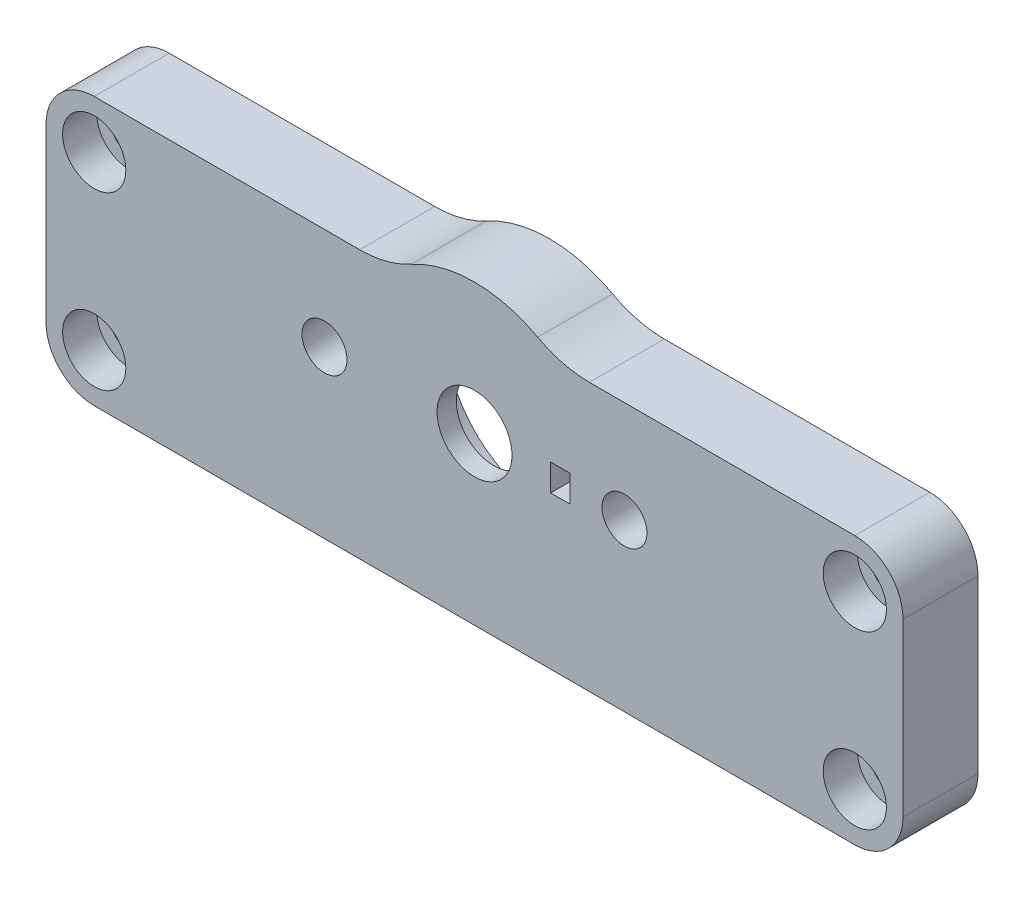
ISO-10303-21;
HEADER;
FILE_DESCRIPTION(('STEP AP214'),'2;1');
FILE_NAME('part.step','',(''),(''),'','','');
FILE_SCHEMA(('AUTOMOTIVE_DESIGN { 1 0 10303 214 1 1 1 1 }'));
ENDSEC;
DATA;
#1=APPLICATION_CONTEXT('core data for automotive mechanical design processes');
#2=APPLICATION_PROTOCOL_DEFINITION('international standard','automotive_design',2000,#1);
#3=PRODUCT_CONTEXT('',#1,'mechanical');
#4=PRODUCT('Part','Part','',(#3));
#5=PRODUCT_RELATED_PRODUCT_CATEGORY('part','',(#4));
#6=PRODUCT_DEFINITION_FORMATION('','',#4);
#7=PRODUCT_DEFINITION_CONTEXT('part definition',#1,'design');
#8=PRODUCT_DEFINITION('design','',#6,#7);
#9=PRODUCT_DEFINITION_SHAPE('','',#8);
#10=(LENGTH_UNIT() NAMED_UNIT(*) SI_UNIT(.MILLI.,.METRE.));
#11=(NAMED_UNIT(*) PLANE_ANGLE_UNIT() SI_UNIT($,.RADIAN.));
#12=(NAMED_UNIT(*) SI_UNIT($,.STERADIAN.) SOLID_ANGLE_UNIT());
#13=UNCERTAINTY_MEASURE_WITH_UNIT(LENGTH_MEASURE(1.E-05),#10,'distance_accuracy_value','');
#14=(GEOMETRIC_REPRESENTATION_CONTEXT(3) GLOBAL_UNCERTAINTY_ASSIGNED_CONTEXT((#13)) GLOBAL_UNIT_ASSIGNED_CONTEXT((#10,
#11,#12)) REPRESENTATION_CONTEXT('',''));
#15=CARTESIAN_POINT('',(0.,0.,0.));
#16=DIRECTION('',(0.,0.,1.));
#17=DIRECTION('',(1.,0.,0.));
#18=AXIS2_PLACEMENT_3D('',#15,#16,#17);
#19=CARTESIAN_POINT('',(-35.5,-11.,7.));
#20=DIRECTION('',(0.,0.,-1.));
#21=DIRECTION('',(-1.,0.,0.));
#22=AXIS2_PLACEMENT_3D('',#19,#20,#21);
#23=CYLINDRICAL_SURFACE('',#22,1.65);
#24=CARTESIAN_POINT('',(-35.5,-11.,0.));
#25=DIRECTION('',(0.,0.,1.));
#26=DIRECTION('',(1.,0.,0.));
#27=AXIS2_PLACEMENT_3D('',#24,#25,#26);
#28=CIRCLE('',#27,1.65);
#29=CARTESIAN_POINT('',(-33.85,-11.,0.));
#30=VERTEX_POINT('',#29);
#31=EDGE_CURVE('E229',#30,#30,#28,.T.);
#32=ORIENTED_EDGE('',*,*,#31,.F.);
#33=EDGE_LOOP('',(#32));
#34=FACE_BOUND('',#33,.T.);
#35=CARTESIAN_POINT('',(-35.5,-11.,3.8));
#36=DIRECTION('',(0.,0.,1.));
#37=DIRECTION('',(1.,0.,0.));
#38=AXIS2_PLACEMENT_3D('',#35,#36,#37);
#39=CIRCLE('',#38,1.65);
#40=CARTESIAN_POINT('',(-33.85,-11.,3.8));
#41=VERTEX_POINT('',#40);
#42=EDGE_CURVE('E45',#41,#41,#39,.T.);
#43=ORIENTED_EDGE('',*,*,#42,.T.);
#44=EDGE_LOOP('',(#43));
#45=FACE_BOUND('',#44,.T.);
#46=ADVANCED_FACE('F41',(#34,#45),#23,.F.);
#47=CARTESIAN_POINT('',(-35.5,5.,7.));
#48=DIRECTION('',(0.,0.,-1.));
#49=DIRECTION('',(-1.,0.,0.));
#50=AXIS2_PLACEMENT_3D('',#47,#48,#49);
#51=CYLINDRICAL_SURFACE('',#50,1.65);
#52=CARTESIAN_POINT('',(-35.5,5.,0.));
#53=DIRECTION('',(0.,0.,1.));
#54=DIRECTION('',(1.,0.,0.));
#55=AXIS2_PLACEMENT_3D('',#52,#53,#54);
#56=CIRCLE('',#55,1.65);
#57=CARTESIAN_POINT('',(-33.85,5.,0.));
#58=VERTEX_POINT('',#57);
#59=EDGE_CURVE('E226',#58,#58,#56,.T.);
#60=ORIENTED_EDGE('',*,*,#59,.F.);
#61=EDGE_LOOP('',(#60));
#62=FACE_BOUND('',#61,.T.);
#63=CARTESIAN_POINT('',(-35.5,5.,3.8));
#64=DIRECTION('',(0.,0.,1.));
#65=DIRECTION('',(1.,0.,0.));
#66=AXIS2_PLACEMENT_3D('',#63,#64,#65);
#67=CIRCLE('',#66,1.65);
#68=CARTESIAN_POINT('',(-33.85,5.,3.8));
#69=VERTEX_POINT('',#68);
#70=EDGE_CURVE('E335',#69,#69,#67,.T.);
#71=ORIENTED_EDGE('',*,*,#70,.T.);
#72=EDGE_LOOP('',(#71));
#73=FACE_BOUND('',#72,.T.);
#74=ADVANCED_FACE('F411',(#62,#73),#51,.F.);
#75=CARTESIAN_POINT('',(35.5,-11.,7.));
#76=DIRECTION('',(0.,0.,-1.));
#77=DIRECTION('',(-1.,0.,0.));
#78=AXIS2_PLACEMENT_3D('',#75,#76,#77);
#79=CYLINDRICAL_SURFACE('',#78,1.65);
#80=CARTESIAN_POINT('',(35.5,-11.,0.));
#81=DIRECTION('',(0.,0.,1.));
#82=DIRECTION('',(-1.,0.,0.));
#83=AXIS2_PLACEMENT_3D('',#80,#81,#82);
#84=CIRCLE('',#83,1.65);
#85=CARTESIAN_POINT('',(33.85,-11.,0.));
#86=VERTEX_POINT('',#85);
#87=EDGE_CURVE('E223',#86,#86,#84,.T.);
#88=ORIENTED_EDGE('',*,*,#87,.F.);
#89=EDGE_LOOP('',(#88));
#90=FACE_BOUND('',#89,.T.);
#91=CARTESIAN_POINT('',(35.5,-11.,3.8));
#92=DIRECTION('',(0.,0.,1.));
#93=DIRECTION('',(1.,0.,0.));
#94=AXIS2_PLACEMENT_3D('',#91,#92,#93);
#95=CIRCLE('',#94,1.65);
#96=CARTESIAN_POINT('',(37.15,-11.,3.8));
#97=VERTEX_POINT('',#96);
#98=EDGE_CURVE('E332',#97,#97,#95,.T.);
#99=ORIENTED_EDGE('',*,*,#98,.T.);
#100=EDGE_LOOP('',(#99));
#101=FACE_BOUND('',#100,.T.);
#102=ADVANCED_FACE('F418',(#90,#101),#79,.F.);
#103=CARTESIAN_POINT('',(35.5,5.,7.));
#104=DIRECTION('',(0.,0.,-1.));
#105=DIRECTION('',(-1.,0.,0.));
#106=AXIS2_PLACEMENT_3D('',#103,#104,#105);
#107=CYLINDRICAL_SURFACE('',#106,1.65);
#108=CARTESIAN_POINT('',(35.5,5.,0.));
#109=DIRECTION('',(0.,0.,1.));
#110=DIRECTION('',(-1.,0.,0.));
#111=AXIS2_PLACEMENT_3D('',#108,#109,#110);
#112=CIRCLE('',#111,1.65);
#113=CARTESIAN_POINT('',(33.85,5.,0.));
#114=VERTEX_POINT('',#113);
#115=EDGE_CURVE('E220',#114,#114,#112,.T.);
#116=ORIENTED_EDGE('',*,*,#115,.F.);
#117=EDGE_LOOP('',(#116));
#118=FACE_BOUND('',#117,.T.);
#119=CARTESIAN_POINT('',(35.5,5.,3.8));
#120=DIRECTION('',(0.,0.,1.));
#121=DIRECTION('',(1.,0.,0.));
#122=AXIS2_PLACEMENT_3D('',#119,#120,#121);
#123=CIRCLE('',#122,1.65);
#124=CARTESIAN_POINT('',(37.15,5.,3.8));
#125=VERTEX_POINT('',#124);
#126=EDGE_CURVE('E329',#125,#125,#123,.T.);
#127=ORIENTED_EDGE('',*,*,#126,.T.);
#128=EDGE_LOOP('',(#127));
#129=FACE_BOUND('',#128,.T.);
#130=ADVANCED_FACE('F521',(#118,#129),#107,.F.);
#131=CARTESIAN_POINT('',(0.,0.,5.));
#132=DIRECTION('',(0.,0.,1.));
#133=DIRECTION('',(1.,0.,0.));
#134=AXIS2_PLACEMENT_3D('',#131,#132,#133);
#135=CYLINDRICAL_SURFACE('',#134,7.5);
#136=CARTESIAN_POINT('',(0.,0.,5.2));
#137=DIRECTION('',(0.,0.,1.));
#138=DIRECTION('',(1.,0.,0.));
#139=AXIS2_PLACEMENT_3D('',#136,#137,#138);
#140=CIRCLE('',#139,7.5);
#141=CARTESIAN_POINT('',(7.39509972887452,-1.25,5.2));
#142=VERTEX_POINT('',#141);
#143=CARTESIAN_POINT('',(7.39509972887452,1.25,5.2));
#144=VERTEX_POINT('',#143);
#145=EDGE_CURVE('E321',#142,#144,#140,.F.);
#146=ORIENTED_EDGE('',*,*,#145,.F.);
#147=DIRECTION('',(0.,0.,1.));
#148=VECTOR('',#147,1.);
#149=CARTESIAN_POINT('',(7.39509972887452,-1.25,5.));
#150=LINE('',#149,#148);
#151=CARTESIAN_POINT('',(7.39509972887452,-1.25,5.));
#152=VERTEX_POINT('',#151);
#153=EDGE_CURVE('E202',#142,#152,#150,.F.);
#154=ORIENTED_EDGE('',*,*,#153,.T.);
#155=CARTESIAN_POINT('',(0.,0.,5.));
#156=DIRECTION('',(0.,0.,1.));
#157=DIRECTION('',(1.,0.,0.));
#158=AXIS2_PLACEMENT_3D('',#155,#156,#157);
#159=CIRCLE('',#158,7.5);
#160=CARTESIAN_POINT('',(7.39509972887452,1.25,5.));
#161=VERTEX_POINT('',#160);
#162=EDGE_CURVE('E212',#161,#152,#159,.T.);
#163=ORIENTED_EDGE('',*,*,#162,.F.);
#164=DIRECTION('',(0.,0.,1.));
#165=VECTOR('',#164,1.);
#166=CARTESIAN_POINT('',(7.39509972887452,1.25,5.));
#167=LINE('',#166,#165);
#168=EDGE_CURVE('E194',#161,#144,#167,.T.);
#169=ORIENTED_EDGE('',*,*,#168,.T.);
#170=EDGE_LOOP('',(#146,#154,#163,#169));
#171=FACE_BOUND('',#170,.T.);
#172=ADVANCED_FACE('F425',(#171),#135,.F.);
#173=CARTESIAN_POINT('',(0.,0.,7.));
#174=DIRECTION('',(0.,0.,-1.));
#175=DIRECTION('',(-1.,0.,0.));
#176=AXIS2_PLACEMENT_3D('',#173,#174,#175);
#177=CYLINDRICAL_SURFACE('',#176,9.75);
#178=CARTESIAN_POINT('',(0.,0.,0.));
#179=DIRECTION('',(0.,0.,1.));
#180=DIRECTION('',(1.,0.,0.));
#181=AXIS2_PLACEMENT_3D('',#178,#179,#180);
#182=CIRCLE('',#181,9.75);
#183=CARTESIAN_POINT('',(9.75,0.,0.));
#184=VERTEX_POINT('',#183);
#185=EDGE_CURVE('E232',#184,#184,#182,.T.);
#186=ORIENTED_EDGE('',*,*,#185,.F.);
#187=EDGE_LOOP('',(#186));
#188=FACE_BOUND('',#187,.T.);
#189=CARTESIAN_POINT('',(0.,0.,5.));
#190=DIRECTION('',(0.,0.,1.));
#191=DIRECTION('',(1.,0.,0.));
#192=AXIS2_PLACEMENT_3D('',#189,#190,#191);
#193=CIRCLE('',#192,9.75);
#194=CARTESIAN_POINT('',(9.75,0.,5.));
#195=VERTEX_POINT('',#194);
#196=EDGE_CURVE('E217',#195,#195,#193,.T.);
#197=ORIENTED_EDGE('',*,*,#196,.T.);
#198=EDGE_LOOP('',(#197));
#199=FACE_BOUND('',#198,.T.);
#200=ADVANCED_FACE('F388',(#188,#199),#177,.F.);
#201=CARTESIAN_POINT('',(0.,0.,7.));
#202=DIRECTION('',(0.,0.,-1.));
#203=DIRECTION('',(-1.,0.,0.));
#204=AXIS2_PLACEMENT_3D('',#201,#202,#203);
#205=PLANE('',#204);
#206=CARTESIAN_POINT('',(35.5,5.,7.));
#207=DIRECTION('',(0.,0.,1.));
#208=DIRECTION('',(1.,0.,0.));
#209=AXIS2_PLACEMENT_3D('',#206,#207,#208);
#210=CIRCLE('',#209,2.95);
#211=CARTESIAN_POINT('',(38.45,5.,7.));
#212=VERTEX_POINT('',#211);
#213=EDGE_CURVE('E368',#212,#212,#210,.T.);
#214=ORIENTED_EDGE('',*,*,#213,.F.);
#215=EDGE_LOOP('',(#214));
#216=FACE_BOUND('',#215,.T.);
#217=CARTESIAN_POINT('',(35.5,-11.,7.));
#218=DIRECTION('',(0.,0.,1.));
#219=DIRECTION('',(1.,0.,0.));
#220=AXIS2_PLACEMENT_3D('',#217,#218,#219);
#221=CIRCLE('',#220,2.95);
#222=CARTESIAN_POINT('',(38.45,-11.,7.));
#223=VERTEX_POINT('',#222);
#224=EDGE_CURVE('E374',#223,#223,#221,.T.);
#225=ORIENTED_EDGE('',*,*,#224,.F.);
#226=EDGE_LOOP('',(#225));
#227=FACE_BOUND('',#226,.T.);
#228=CARTESIAN_POINT('',(-35.5,-11.,7.));
#229=DIRECTION('',(0.,0.,1.));
#230=DIRECTION('',(1.,0.,0.));
#231=AXIS2_PLACEMENT_3D('',#228,#229,#230);
#232=CIRCLE('',#231,2.95);
#233=CARTESIAN_POINT('',(-32.55,-11.,7.));
#234=VERTEX_POINT('',#233);
#235=EDGE_CURVE('E362',#234,#234,#232,.T.);
#236=ORIENTED_EDGE('',*,*,#235,.F.);
#237=EDGE_LOOP('',(#236));
#238=FACE_BOUND('',#237,.T.);
#239=CARTESIAN_POINT('',(-35.5,5.,7.));
#240=DIRECTION('',(0.,0.,1.));
#241=DIRECTION('',(1.,0.,0.));
#242=AXIS2_PLACEMENT_3D('',#239,#240,#241);
#243=CIRCLE('',#242,2.95);
#244=CARTESIAN_POINT('',(-32.55,5.,7.));
#245=VERTEX_POINT('',#244);
#246=EDGE_CURVE('E359',#245,#245,#243,.T.);
#247=ORIENTED_EDGE('',*,*,#246,.F.);
#248=EDGE_LOOP('',(#247));
#249=FACE_BOUND('',#248,.T.);
#250=CARTESIAN_POINT('',(-14.,0.,7.));
#251=DIRECTION('',(0.,0.,1.));
#252=DIRECTION('',(1.,0.,0.));
#253=AXIS2_PLACEMENT_3D('',#250,#251,#252);
#254=CIRCLE('',#253,2.1);
#255=CARTESIAN_POINT('',(-11.9,0.,7.));
#256=VERTEX_POINT('',#255);
#257=EDGE_CURVE('E349',#256,#256,#254,.T.);
#258=ORIENTED_EDGE('',*,*,#257,.F.);
#259=EDGE_LOOP('',(#258));
#260=FACE_BOUND('',#259,.T.);
#261=CARTESIAN_POINT('',(14.,0.,7.));
#262=DIRECTION('',(0.,0.,1.));
#263=DIRECTION('',(-1.,0.,0.));
#264=AXIS2_PLACEMENT_3D('',#261,#262,#263);
#265=CIRCLE('',#264,2.1);
#266=CARTESIAN_POINT('',(11.9,0.,7.));
#267=VERTEX_POINT('',#266);
#268=EDGE_CURVE('E344',#267,#267,#265,.T.);
#269=ORIENTED_EDGE('',*,*,#268,.F.);
#270=EDGE_LOOP('',(#269));
#271=FACE_BOUND('',#270,.T.);
#272=DIRECTION('',(-1.,0.,0.));
#273=VECTOR('',#272,1.);
#274=CARTESIAN_POINT('',(7.1,1.25,7.));
#275=LINE('',#274,#273);
#276=CARTESIAN_POINT('',(8.9,1.25,7.));
#277=VERTEX_POINT('',#276);
#278=CARTESIAN_POINT('',(7.1,1.25,7.));
#279=VERTEX_POINT('',#278);
#280=EDGE_CURVE('E180',#277,#279,#275,.T.);
#281=ORIENTED_EDGE('',*,*,#280,.F.);
#282=DIRECTION('',(0.,1.,0.));
#283=VECTOR('',#282,1.);
#284=CARTESIAN_POINT('',(8.9,-1.25,7.));
#285=LINE('',#284,#283);
#286=CARTESIAN_POINT('',(8.9,-1.25,7.));
#287=VERTEX_POINT('',#286);
#288=EDGE_CURVE('E58',#287,#277,#285,.T.);
#289=ORIENTED_EDGE('',*,*,#288,.F.);
#290=DIRECTION('',(1.,0.,0.));
#291=VECTOR('',#290,1.);
#292=CARTESIAN_POINT('',(7.1,-1.25,7.));
#293=LINE('',#292,#291);
#294=CARTESIAN_POINT('',(7.1,-1.25,7.));
#295=VERTEX_POINT('',#294);
#296=EDGE_CURVE('E187',#295,#287,#293,.T.);
#297=ORIENTED_EDGE('',*,*,#296,.F.);
#298=DIRECTION('',(0.,-1.,0.));
#299=VECTOR('',#298,1.);
#300=CARTESIAN_POINT('',(7.1,-1.25,7.));
#301=LINE('',#300,#299);
#302=EDGE_CURVE('E171',#279,#295,#301,.T.);
#303=ORIENTED_EDGE('',*,*,#302,.F.);
#304=EDGE_LOOP('',(#281,#289,#297,#303));
#305=FACE_BOUND('',#304,.T.);
#306=DIRECTION('',(-1.,0.,0.));
#307=VECTOR('',#306,1.);
#308=CARTESIAN_POINT('',(35.5,9.49999999999999,7.));
#309=LINE('',#308,#307);
#310=CARTESIAN_POINT('',(35.5,9.5,7.));
#311=VERTEX_POINT('',#310);
#312=CARTESIAN_POINT('',(10.7150594958684,9.49999999999999,7.));
#313=VERTEX_POINT('',#312);
#314=EDGE_CURVE('E256',#311,#313,#309,.T.);
#315=ORIENTED_EDGE('',*,*,#314,.T.);
#316=CARTESIAN_POINT('',(10.7150594958684,19.5,7.));
#317=DIRECTION('',(0.,0.,-1.));
#318=DIRECTION('',(-1.,0.,0.));
#319=AXIS2_PLACEMENT_3D('',#316,#317,#318);
#320=CIRCLE('',#319,10.);
#321=CARTESIAN_POINT('',(5.89930241907363,10.7359550561798,7.));
#322=VERTEX_POINT('',#321);
#323=EDGE_CURVE('E315',#313,#322,#320,.T.);
#324=ORIENTED_EDGE('',*,*,#323,.T.);
#325=CARTESIAN_POINT('',(0.,0.,7.));
#326=DIRECTION('',(0.,0.,1.));
#327=DIRECTION('',(-1.,0.,0.));
#328=AXIS2_PLACEMENT_3D('',#325,#326,#327);
#329=CIRCLE('',#328,12.25);
#330=CARTESIAN_POINT('',(-5.89930241907363,10.7359550561798,7.));
#331=VERTEX_POINT('',#330);
#332=EDGE_CURVE('E236',#322,#331,#329,.T.);
#333=ORIENTED_EDGE('',*,*,#332,.T.);
#334=CARTESIAN_POINT('',(-10.7150594958684,19.5,7.));
#335=DIRECTION('',(0.,0.,-1.));
#336=DIRECTION('',(-1.,0.,0.));
#337=AXIS2_PLACEMENT_3D('',#334,#335,#336);
#338=CIRCLE('',#337,10.);
#339=CARTESIAN_POINT('',(-10.7150594958684,9.49999999999999,7.));
#340=VERTEX_POINT('',#339);
#341=EDGE_CURVE('E319',#331,#340,#338,.T.);
#342=ORIENTED_EDGE('',*,*,#341,.T.);
#343=DIRECTION('',(-1.,0.,0.));
#344=VECTOR('',#343,1.);
#345=CARTESIAN_POINT('',(-35.5,9.49999999999999,7.));
#346=LINE('',#345,#344);
#347=CARTESIAN_POINT('',(-35.5,9.49999999999999,7.));
#348=VERTEX_POINT('',#347);
#349=EDGE_CURVE('E239',#340,#348,#346,.T.);
#350=ORIENTED_EDGE('',*,*,#349,.T.);
#351=CARTESIAN_POINT('',(-35.5,5.,7.));
#352=DIRECTION('',(0.,0.,1.));
#353=DIRECTION('',(-1.,0.,0.));
#354=AXIS2_PLACEMENT_3D('',#351,#352,#353);
#355=CIRCLE('',#354,4.5);
#356=CARTESIAN_POINT('',(-40.,5.,7.));
#357=VERTEX_POINT('',#356);
#358=EDGE_CURVE('E242',#348,#357,#355,.T.);
#359=ORIENTED_EDGE('',*,*,#358,.T.);
#360=DIRECTION('',(0.,-1.,0.));
#361=VECTOR('',#360,1.);
#362=CARTESIAN_POINT('',(-40.,-11.,7.));
#363=LINE('',#362,#361);
#364=CARTESIAN_POINT('',(-40.,-11.,7.));
#365=VERTEX_POINT('',#364);
#366=EDGE_CURVE('E244',#357,#365,#363,.T.);
#367=ORIENTED_EDGE('',*,*,#366,.T.);
#368=CARTESIAN_POINT('',(-35.5,-11.,7.));
#369=DIRECTION('',(0.,0.,1.));
#370=DIRECTION('',(-1.,0.,0.));
#371=AXIS2_PLACEMENT_3D('',#368,#369,#370);
#372=CIRCLE('',#371,4.5);
#373=CARTESIAN_POINT('',(-35.5,-15.5,7.));
#374=VERTEX_POINT('',#373);
#375=EDGE_CURVE('E246',#365,#374,#372,.T.);
#376=ORIENTED_EDGE('',*,*,#375,.T.);
#377=DIRECTION('',(1.,0.,0.));
#378=VECTOR('',#377,1.);
#379=CARTESIAN_POINT('',(35.5,-15.5,7.));
#380=LINE('',#379,#378);
#381=CARTESIAN_POINT('',(35.5,-15.5,7.));
#382=VERTEX_POINT('',#381);
#383=EDGE_CURVE('E248',#374,#382,#380,.T.);
#384=ORIENTED_EDGE('',*,*,#383,.T.);
#385=CARTESIAN_POINT('',(35.5,-11.,7.));
#386=DIRECTION('',(0.,0.,1.));
#387=DIRECTION('',(1.,0.,0.));
#388=AXIS2_PLACEMENT_3D('',#385,#386,#387);
#389=CIRCLE('',#388,4.5);
#390=CARTESIAN_POINT('',(40.,-11.,7.));
#391=VERTEX_POINT('',#390);
#392=EDGE_CURVE('E250',#382,#391,#389,.T.);
#393=ORIENTED_EDGE('',*,*,#392,.T.);
#394=DIRECTION('',(0.,1.,0.));
#395=VECTOR('',#394,1.);
#396=CARTESIAN_POINT('',(40.,-11.,7.));
#397=LINE('',#396,#395);
#398=CARTESIAN_POINT('',(40.,5.,7.));
#399=VERTEX_POINT('',#398);
#400=EDGE_CURVE('E252',#391,#399,#397,.T.);
#401=ORIENTED_EDGE('',*,*,#400,.T.);
#402=CARTESIAN_POINT('',(35.5,5.,7.));
#403=DIRECTION('',(0.,0.,1.));
#404=DIRECTION('',(1.,0.,0.));
#405=AXIS2_PLACEMENT_3D('',#402,#403,#404);
#406=CIRCLE('',#405,4.5);
#407=EDGE_CURVE('E254',#399,#311,#406,.T.);
#408=ORIENTED_EDGE('',*,*,#407,.T.);
#409=EDGE_LOOP('',(#315,#324,#333,#342,#350,#359,#367,#376,#384,#393,#401,#408));
#410=FACE_BOUND('',#409,.T.);
#411=CARTESIAN_POINT('',(0.,0.,7.));
#412=DIRECTION('',(0.,0.,1.));
#413=DIRECTION('',(1.,0.,0.));
#414=AXIS2_PLACEMENT_3D('',#411,#412,#413);
#415=CIRCLE('',#414,3.5);
#416=CARTESIAN_POINT('',(3.5,0.,7.));
#417=VERTEX_POINT('',#416);
#418=EDGE_CURVE('E208',#417,#417,#415,.T.);
#419=ORIENTED_EDGE('',*,*,#418,.F.);
#420=EDGE_LOOP('',(#419));
#421=FACE_BOUND('',#420,.T.);
#422=ADVANCED_FACE('F184',(#216,#227,#238,#249,#260,#271,#305,#410,#421),#205,.F.);
#423=CARTESIAN_POINT('',(0.,0.,0.));
#424=DIRECTION('',(0.,0.,-1.));
#425=DIRECTION('',(-1.,0.,0.));
#426=AXIS2_PLACEMENT_3D('',#423,#424,#425);
#427=PLANE('',#426);
#428=ORIENTED_EDGE('',*,*,#87,.T.);
#429=EDGE_LOOP('',(#428));
#430=FACE_BOUND('',#429,.T.);
#431=ORIENTED_EDGE('',*,*,#31,.T.);
#432=EDGE_LOOP('',(#431));
#433=FACE_BOUND('',#432,.T.);
#434=CARTESIAN_POINT('',(0.,0.,0.));
#435=DIRECTION('',(0.,0.,1.));
#436=DIRECTION('',(-1.,0.,0.));
#437=AXIS2_PLACEMENT_3D('',#434,#435,#436);
#438=CIRCLE('',#437,12.25);
#439=CARTESIAN_POINT('',(5.89930241907363,10.7359550561798,0.));
#440=VERTEX_POINT('',#439);
#441=CARTESIAN_POINT('',(-5.89930241907363,10.7359550561798,0.));
#442=VERTEX_POINT('',#441);
#443=EDGE_CURVE('E235',#440,#442,#438,.T.);
#444=ORIENTED_EDGE('',*,*,#443,.F.);
#445=CARTESIAN_POINT('',(10.7150594958684,19.5,0.));
#446=DIRECTION('',(0.,0.,-1.));
#447=DIRECTION('',(-1.,0.,0.));
#448=AXIS2_PLACEMENT_3D('',#445,#446,#447);
#449=CIRCLE('',#448,10.);
#450=CARTESIAN_POINT('',(10.7150594958684,9.49999999999999,0.));
#451=VERTEX_POINT('',#450);
#452=EDGE_CURVE('E313',#440,#451,#449,.F.);
#453=ORIENTED_EDGE('',*,*,#452,.T.);
#454=DIRECTION('',(-1.,0.,0.));
#455=VECTOR('',#454,1.);
#456=CARTESIAN_POINT('',(35.5,9.49999999999999,0.));
#457=LINE('',#456,#455);
#458=CARTESIAN_POINT('',(35.5,9.5,0.));
#459=VERTEX_POINT('',#458);
#460=EDGE_CURVE('E240',#459,#451,#457,.T.);
#461=ORIENTED_EDGE('',*,*,#460,.F.);
#462=CARTESIAN_POINT('',(35.5,5.,0.));
#463=DIRECTION('',(0.,0.,1.));
#464=DIRECTION('',(1.,0.,0.));
#465=AXIS2_PLACEMENT_3D('',#462,#463,#464);
#466=CIRCLE('',#465,4.5);
#467=CARTESIAN_POINT('',(40.,5.,0.));
#468=VERTEX_POINT('',#467);
#469=EDGE_CURVE('E276',#468,#459,#466,.T.);
#470=ORIENTED_EDGE('',*,*,#469,.F.);
#471=DIRECTION('',(0.,1.,0.));
#472=VECTOR('',#471,1.);
#473=CARTESIAN_POINT('',(40.,-11.,0.));
#474=LINE('',#473,#472);
#475=CARTESIAN_POINT('',(40.,-11.,0.));
#476=VERTEX_POINT('',#475);
#477=EDGE_CURVE('E274',#476,#468,#474,.T.);
#478=ORIENTED_EDGE('',*,*,#477,.F.);
#479=CARTESIAN_POINT('',(35.5,-11.,0.));
#480=DIRECTION('',(0.,0.,1.));
#481=DIRECTION('',(1.,0.,0.));
#482=AXIS2_PLACEMENT_3D('',#479,#480,#481);
#483=CIRCLE('',#482,4.5);
#484=CARTESIAN_POINT('',(35.5,-15.5,0.));
#485=VERTEX_POINT('',#484);
#486=EDGE_CURVE('E272',#485,#476,#483,.T.);
#487=ORIENTED_EDGE('',*,*,#486,.F.);
#488=DIRECTION('',(1.,0.,0.));
#489=VECTOR('',#488,1.);
#490=CARTESIAN_POINT('',(35.5,-15.5,0.));
#491=LINE('',#490,#489);
#492=CARTESIAN_POINT('',(-35.5,-15.5,0.));
#493=VERTEX_POINT('',#492);
#494=EDGE_CURVE('E270',#493,#485,#491,.T.);
#495=ORIENTED_EDGE('',*,*,#494,.F.);
#496=CARTESIAN_POINT('',(-35.5,-11.,0.));
#497=DIRECTION('',(0.,0.,1.));
#498=DIRECTION('',(-1.,0.,0.));
#499=AXIS2_PLACEMENT_3D('',#496,#497,#498);
#500=CIRCLE('',#499,4.5);
#501=CARTESIAN_POINT('',(-40.,-11.,0.));
#502=VERTEX_POINT('',#501);
#503=EDGE_CURVE('E268',#502,#493,#500,.T.);
#504=ORIENTED_EDGE('',*,*,#503,.F.);
#505=DIRECTION('',(0.,-1.,0.));
#506=VECTOR('',#505,1.);
#507=CARTESIAN_POINT('',(-40.,-11.,0.));
#508=LINE('',#507,#506);
#509=CARTESIAN_POINT('',(-40.,5.,0.));
#510=VERTEX_POINT('',#509);
#511=EDGE_CURVE('E266',#510,#502,#508,.T.);
#512=ORIENTED_EDGE('',*,*,#511,.F.);
#513=CARTESIAN_POINT('',(-35.5,5.,0.));
#514=DIRECTION('',(0.,0.,1.));
#515=DIRECTION('',(-1.,0.,0.));
#516=AXIS2_PLACEMENT_3D('',#513,#514,#515);
#517=CIRCLE('',#516,4.5);
#518=CARTESIAN_POINT('',(-35.5,9.49999999999999,0.));
#519=VERTEX_POINT('',#518);
#520=EDGE_CURVE('E264',#519,#510,#517,.T.);
#521=ORIENTED_EDGE('',*,*,#520,.F.);
#522=DIRECTION('',(-1.,0.,0.));
#523=VECTOR('',#522,1.);
#524=CARTESIAN_POINT('',(-35.5,9.49999999999999,0.));
#525=LINE('',#524,#523);
#526=CARTESIAN_POINT('',(-10.7150594958684,9.49999999999999,0.));
#527=VERTEX_POINT('',#526);
#528=EDGE_CURVE('E262',#527,#519,#525,.T.);
#529=ORIENTED_EDGE('',*,*,#528,.F.);
#530=CARTESIAN_POINT('',(-10.7150594958684,19.5,0.));
#531=DIRECTION('',(0.,0.,-1.));
#532=DIRECTION('',(-1.,0.,0.));
#533=AXIS2_PLACEMENT_3D('',#530,#531,#532);
#534=CIRCLE('',#533,10.);
#535=EDGE_CURVE('E317',#527,#442,#534,.F.);
#536=ORIENTED_EDGE('',*,*,#535,.T.);
#537=EDGE_LOOP('',(#444,#453,#461,#470,#478,#487,#495,#504,#512,#521,#529,#536));
#538=FACE_BOUND('',#537,.T.);
#539=ORIENTED_EDGE('',*,*,#185,.T.);
#540=EDGE_LOOP('',(#539));
#541=FACE_BOUND('',#540,.T.);
#542=ORIENTED_EDGE('',*,*,#59,.T.);
#543=EDGE_LOOP('',(#542));
#544=FACE_BOUND('',#543,.T.);
#545=ORIENTED_EDGE('',*,*,#115,.T.);
#546=EDGE_LOOP('',(#545));
#547=FACE_BOUND('',#546,.T.);
#548=ADVANCED_FACE('F387',(#430,#433,#538,#541,#544,#547),#427,.T.);
#549=CARTESIAN_POINT('',(0.,0.,7.));
#550=DIRECTION('',(0.,0.,-1.));
#551=DIRECTION('',(-1.,0.,0.));
#552=AXIS2_PLACEMENT_3D('',#549,#550,#551);
#553=CYLINDRICAL_SURFACE('',#552,12.25);
#554=ORIENTED_EDGE('',*,*,#332,.F.);
#555=DIRECTION('',(0.,0.,-1.));
#556=VECTOR('',#555,1.);
#557=CARTESIAN_POINT('',(5.89930241907363,10.7359550561798,7.));
#558=LINE('',#557,#556);
#559=EDGE_CURVE('E305',#322,#440,#558,.T.);
#560=ORIENTED_EDGE('',*,*,#559,.T.);
#561=ORIENTED_EDGE('',*,*,#443,.T.);
#562=DIRECTION('',(0.,0.,-1.));
#563=VECTOR('',#562,1.);
#564=CARTESIAN_POINT('',(-5.89930241907363,10.7359550561798,7.));
#565=LINE('',#564,#563);
#566=EDGE_CURVE('E303',#442,#331,#565,.F.);
#567=ORIENTED_EDGE('',*,*,#566,.T.);
#568=EDGE_LOOP('',(#554,#560,#561,#567));
#569=FACE_BOUND('',#568,.T.);
#570=ADVANCED_FACE('F430',(#569),#553,.T.);
#571=CARTESIAN_POINT('',(-35.5,9.49999999999999,7.));
#572=DIRECTION('',(0.,-1.,0.));
#573=DIRECTION('',(0.,0.,-1.));
#574=AXIS2_PLACEMENT_3D('',#571,#572,#573);
#575=PLANE('',#574);
#576=ORIENTED_EDGE('',*,*,#349,.F.);
#577=DIRECTION('',(0.,0.,1.));
#578=VECTOR('',#577,1.);
#579=CARTESIAN_POINT('',(-10.7150594958684,9.49999999999999,0.));
#580=LINE('',#579,#578);
#581=EDGE_CURVE('E310',#340,#527,#580,.F.);
#582=ORIENTED_EDGE('',*,*,#581,.T.);
#583=ORIENTED_EDGE('',*,*,#528,.T.);
#584=DIRECTION('',(0.,0.,-1.));
#585=VECTOR('',#584,1.);
#586=CARTESIAN_POINT('',(-35.5,9.49999999999999,7.));
#587=LINE('',#586,#585);
#588=EDGE_CURVE('E300',#348,#519,#587,.T.);
#589=ORIENTED_EDGE('',*,*,#588,.F.);
#590=EDGE_LOOP('',(#576,#582,#583,#589));
#591=FACE_BOUND('',#590,.T.);
#592=ADVANCED_FACE('F464',(#591),#575,.F.);
#593=CARTESIAN_POINT('',(-35.5,5.,7.));
#594=DIRECTION('',(0.,0.,-1.));
#595=DIRECTION('',(-1.,0.,0.));
#596=AXIS2_PLACEMENT_3D('',#593,#594,#595);
#597=CYLINDRICAL_SURFACE('',#596,4.5);
#598=ORIENTED_EDGE('',*,*,#520,.T.);
#599=DIRECTION('',(0.,0.,-1.));
#600=VECTOR('',#599,1.);
#601=CARTESIAN_POINT('',(-40.,5.,7.));
#602=LINE('',#601,#600);
#603=EDGE_CURVE('E297',#357,#510,#602,.T.);
#604=ORIENTED_EDGE('',*,*,#603,.F.);
#605=ORIENTED_EDGE('',*,*,#358,.F.);
#606=ORIENTED_EDGE('',*,*,#588,.T.);
#607=EDGE_LOOP('',(#598,#604,#605,#606));
#608=FACE_BOUND('',#607,.T.);
#609=ADVANCED_FACE('F460',(#608),#597,.T.);
#610=CARTESIAN_POINT('',(-40.,-11.,7.));
#611=DIRECTION('',(1.,0.,0.));
#612=DIRECTION('',(0.,1.,0.));
#613=AXIS2_PLACEMENT_3D('',#610,#611,#612);
#614=PLANE('',#613);
#615=ORIENTED_EDGE('',*,*,#511,.T.);
#616=DIRECTION('',(0.,0.,-1.));
#617=VECTOR('',#616,1.);
#618=CARTESIAN_POINT('',(-40.,-11.,7.));
#619=LINE('',#618,#617);
#620=EDGE_CURVE('E294',#365,#502,#619,.T.);
#621=ORIENTED_EDGE('',*,*,#620,.F.);
#622=ORIENTED_EDGE('',*,*,#366,.F.);
#623=ORIENTED_EDGE('',*,*,#603,.T.);
#624=EDGE_LOOP('',(#615,#621,#622,#623));
#625=FACE_BOUND('',#624,.T.);
#626=ADVANCED_FACE('F456',(#625),#614,.F.);
#627=CARTESIAN_POINT('',(-35.5,-11.,7.));
#628=DIRECTION('',(0.,0.,-1.));
#629=DIRECTION('',(-1.,0.,0.));
#630=AXIS2_PLACEMENT_3D('',#627,#628,#629);
#631=CYLINDRICAL_SURFACE('',#630,4.5);
#632=ORIENTED_EDGE('',*,*,#503,.T.);
#633=DIRECTION('',(0.,0.,-1.));
#634=VECTOR('',#633,1.);
#635=CARTESIAN_POINT('',(-35.5,-15.5,7.));
#636=LINE('',#635,#634);
#637=EDGE_CURVE('E291',#374,#493,#636,.T.);
#638=ORIENTED_EDGE('',*,*,#637,.F.);
#639=ORIENTED_EDGE('',*,*,#375,.F.);
#640=ORIENTED_EDGE('',*,*,#620,.T.);
#641=EDGE_LOOP('',(#632,#638,#639,#640));
#642=FACE_BOUND('',#641,.T.);
#643=ADVANCED_FACE('F452',(#642),#631,.T.);
#644=CARTESIAN_POINT('',(35.5,-15.5,7.));
#645=DIRECTION('',(0.,1.,0.));
#646=DIRECTION('',(0.,0.,1.));
#647=AXIS2_PLACEMENT_3D('',#644,#645,#646);
#648=PLANE('',#647);
#649=ORIENTED_EDGE('',*,*,#494,.T.);
#650=DIRECTION('',(0.,0.,-1.));
#651=VECTOR('',#650,1.);
#652=CARTESIAN_POINT('',(35.5,-15.5,7.));
#653=LINE('',#652,#651);
#654=EDGE_CURVE('E288',#382,#485,#653,.T.);
#655=ORIENTED_EDGE('',*,*,#654,.F.);
#656=ORIENTED_EDGE('',*,*,#383,.F.);
#657=ORIENTED_EDGE('',*,*,#637,.T.);
#658=EDGE_LOOP('',(#649,#655,#656,#657));
#659=FACE_BOUND('',#658,.T.);
#660=ADVANCED_FACE('F448',(#659),#648,.F.);
#661=CARTESIAN_POINT('',(35.5,-11.,7.));
#662=DIRECTION('',(0.,0.,-1.));
#663=DIRECTION('',(-1.,0.,0.));
#664=AXIS2_PLACEMENT_3D('',#661,#662,#663);
#665=CYLINDRICAL_SURFACE('',#664,4.5);
#666=ORIENTED_EDGE('',*,*,#486,.T.);
#667=DIRECTION('',(0.,0.,-1.));
#668=VECTOR('',#667,1.);
#669=CARTESIAN_POINT('',(40.,-11.,7.));
#670=LINE('',#669,#668);
#671=EDGE_CURVE('E285',#391,#476,#670,.T.);
#672=ORIENTED_EDGE('',*,*,#671,.F.);
#673=ORIENTED_EDGE('',*,*,#392,.F.);
#674=ORIENTED_EDGE('',*,*,#654,.T.);
#675=EDGE_LOOP('',(#666,#672,#673,#674));
#676=FACE_BOUND('',#675,.T.);
#677=ADVANCED_FACE('F444',(#676),#665,.T.);
#678=CARTESIAN_POINT('',(40.,-11.,7.));
#679=DIRECTION('',(-1.,0.,0.));
#680=DIRECTION('',(0.,-1.,0.));
#681=AXIS2_PLACEMENT_3D('',#678,#679,#680);
#682=PLANE('',#681);
#683=ORIENTED_EDGE('',*,*,#477,.T.);
#684=DIRECTION('',(0.,0.,-1.));
#685=VECTOR('',#684,1.);
#686=CARTESIAN_POINT('',(40.,5.,7.));
#687=LINE('',#686,#685);
#688=EDGE_CURVE('E282',#399,#468,#687,.T.);
#689=ORIENTED_EDGE('',*,*,#688,.F.);
#690=ORIENTED_EDGE('',*,*,#400,.F.);
#691=ORIENTED_EDGE('',*,*,#671,.T.);
#692=EDGE_LOOP('',(#683,#689,#690,#691));
#693=FACE_BOUND('',#692,.T.);
#694=ADVANCED_FACE('F440',(#693),#682,.F.);
#695=CARTESIAN_POINT('',(35.5,5.,7.));
#696=DIRECTION('',(0.,0.,-1.));
#697=DIRECTION('',(-1.,0.,0.));
#698=AXIS2_PLACEMENT_3D('',#695,#696,#697);
#699=CYLINDRICAL_SURFACE('',#698,4.5);
#700=ORIENTED_EDGE('',*,*,#469,.T.);
#701=DIRECTION('',(0.,0.,-1.));
#702=VECTOR('',#701,1.);
#703=CARTESIAN_POINT('',(35.5,9.5,7.));
#704=LINE('',#703,#702);
#705=EDGE_CURVE('E259',#311,#459,#704,.T.);
#706=ORIENTED_EDGE('',*,*,#705,.F.);
#707=ORIENTED_EDGE('',*,*,#407,.F.);
#708=ORIENTED_EDGE('',*,*,#688,.T.);
#709=EDGE_LOOP('',(#700,#706,#707,#708));
#710=FACE_BOUND('',#709,.T.);
#711=ADVANCED_FACE('F436',(#710),#699,.T.);
#712=CARTESIAN_POINT('',(35.5,9.49999999999999,7.));
#713=DIRECTION('',(0.,-1.,0.));
#714=DIRECTION('',(0.,0.,-1.));
#715=AXIS2_PLACEMENT_3D('',#712,#713,#714);
#716=PLANE('',#715);
#717=ORIENTED_EDGE('',*,*,#460,.T.);
#718=DIRECTION('',(0.,0.,1.));
#719=VECTOR('',#718,1.);
#720=CARTESIAN_POINT('',(10.7150594958684,9.49999999999999,7.));
#721=LINE('',#720,#719);
#722=EDGE_CURVE('E308',#451,#313,#721,.T.);
#723=ORIENTED_EDGE('',*,*,#722,.T.);
#724=ORIENTED_EDGE('',*,*,#314,.F.);
#725=ORIENTED_EDGE('',*,*,#705,.T.);
#726=EDGE_LOOP('',(#717,#723,#724,#725));
#727=FACE_BOUND('',#726,.T.);
#728=ADVANCED_FACE('F432',(#727),#716,.F.);
#729=CARTESIAN_POINT('',(10.7150594958684,19.5,7.));
#730=DIRECTION('',(0.,0.,-1.));
#731=DIRECTION('',(-1.,0.,0.));
#732=AXIS2_PLACEMENT_3D('',#729,#730,#731);
#733=CYLINDRICAL_SURFACE('',#732,10.);
#734=ORIENTED_EDGE('',*,*,#323,.F.);
#735=ORIENTED_EDGE('',*,*,#722,.F.);
#736=ORIENTED_EDGE('',*,*,#452,.F.);
#737=ORIENTED_EDGE('',*,*,#559,.F.);
#738=EDGE_LOOP('',(#734,#735,#736,#737));
#739=FACE_BOUND('',#738,.T.);
#740=ADVANCED_FACE('F435',(#739),#733,.F.);
#741=CARTESIAN_POINT('',(-10.7150594958684,19.5,7.));
#742=DIRECTION('',(0.,0.,-1.));
#743=DIRECTION('',(-1.,0.,0.));
#744=AXIS2_PLACEMENT_3D('',#741,#742,#743);
#745=CYLINDRICAL_SURFACE('',#744,10.);
#746=ORIENTED_EDGE('',*,*,#341,.F.);
#747=ORIENTED_EDGE('',*,*,#566,.F.);
#748=ORIENTED_EDGE('',*,*,#535,.F.);
#749=ORIENTED_EDGE('',*,*,#581,.F.);
#750=EDGE_LOOP('',(#746,#747,#748,#749));
#751=FACE_BOUND('',#750,.T.);
#752=ADVANCED_FACE('F43',(#751),#745,.F.);
#753=CARTESIAN_POINT('',(0.,0.,5.));
#754=DIRECTION('',(0.,0.,1.));
#755=DIRECTION('',(1.,0.,0.));
#756=AXIS2_PLACEMENT_3D('',#753,#754,#755);
#757=PLANE('',#756);
#758=ORIENTED_EDGE('',*,*,#162,.T.);
#759=DIRECTION('',(1.,0.,0.));
#760=VECTOR('',#759,1.);
#761=CARTESIAN_POINT('',(0.,-1.25,5.));
#762=LINE('',#761,#760);
#763=CARTESIAN_POINT('',(8.9,-1.25,5.));
#764=VERTEX_POINT('',#763);
#765=EDGE_CURVE('E205',#152,#764,#762,.T.);
#766=ORIENTED_EDGE('',*,*,#765,.T.);
#767=DIRECTION('',(0.,1.,0.));
#768=VECTOR('',#767,1.);
#769=CARTESIAN_POINT('',(8.9,0.,5.));
#770=LINE('',#769,#768);
#771=CARTESIAN_POINT('',(8.9,1.25,5.));
#772=VERTEX_POINT('',#771);
#773=EDGE_CURVE('E11',#764,#772,#770,.T.);
#774=ORIENTED_EDGE('',*,*,#773,.T.);
#775=DIRECTION('',(-1.,0.,0.));
#776=VECTOR('',#775,1.);
#777=CARTESIAN_POINT('',(0.,1.25,5.));
#778=LINE('',#777,#776);
#779=EDGE_CURVE('E199',#772,#161,#778,.T.);
#780=ORIENTED_EDGE('',*,*,#779,.T.);
#781=EDGE_LOOP('',(#758,#766,#774,#780));
#782=FACE_BOUND('',#781,.T.);
#783=ORIENTED_EDGE('',*,*,#196,.F.);
#784=EDGE_LOOP('',(#783));
#785=FACE_BOUND('',#784,.T.);
#786=ADVANCED_FACE('F476',(#782,#785),#757,.F.);
#787=CARTESIAN_POINT('',(0.,0.,5.2));
#788=DIRECTION('',(0.,0.,1.));
#789=DIRECTION('',(1.,0.,0.));
#790=AXIS2_PLACEMENT_3D('',#787,#788,#789);
#791=PLANE('',#790);
#792=CARTESIAN_POINT('',(0.,0.,5.2));
#793=DIRECTION('',(0.,0.,1.));
#794=DIRECTION('',(1.,0.,0.));
#795=AXIS2_PLACEMENT_3D('',#792,#793,#794);
#796=CIRCLE('',#795,3.5);
#797=CARTESIAN_POINT('',(3.5,0.,5.2));
#798=VERTEX_POINT('',#797);
#799=EDGE_CURVE('E209',#798,#798,#796,.T.);
#800=ORIENTED_EDGE('',*,*,#799,.T.);
#801=EDGE_LOOP('',(#800));
#802=FACE_BOUND('',#801,.T.);
#803=DIRECTION('',(0.,-1.,0.));
#804=VECTOR('',#803,1.);
#805=CARTESIAN_POINT('',(7.1,0.,5.2));
#806=LINE('',#805,#804);
#807=CARTESIAN_POINT('',(7.1,1.25,5.2));
#808=VERTEX_POINT('',#807);
#809=CARTESIAN_POINT('',(7.1,-1.25,5.2));
#810=VERTEX_POINT('',#809);
#811=EDGE_CURVE('E174',#808,#810,#806,.T.);
#812=ORIENTED_EDGE('',*,*,#811,.T.);
#813=DIRECTION('',(1.,0.,0.));
#814=VECTOR('',#813,1.);
#815=CARTESIAN_POINT('',(0.,-1.25,5.2));
#816=LINE('',#815,#814);
#817=EDGE_CURVE('E50',#810,#142,#816,.T.);
#818=ORIENTED_EDGE('',*,*,#817,.T.);
#819=ORIENTED_EDGE('',*,*,#145,.T.);
#820=DIRECTION('',(-1.,0.,0.));
#821=VECTOR('',#820,1.);
#822=CARTESIAN_POINT('',(0.,1.25,5.2));
#823=LINE('',#822,#821);
#824=EDGE_CURVE('E324',#144,#808,#823,.T.);
#825=ORIENTED_EDGE('',*,*,#824,.T.);
#826=EDGE_LOOP('',(#812,#818,#819,#825));
#827=FACE_BOUND('',#826,.T.);
#828=ADVANCED_FACE('F672',(#802,#827),#791,.F.);
#829=CARTESIAN_POINT('',(0.,0.,5.2));
#830=DIRECTION('',(0.,0.,1.));
#831=DIRECTION('',(1.,0.,0.));
#832=AXIS2_PLACEMENT_3D('',#829,#830,#831);
#833=CYLINDRICAL_SURFACE('',#832,3.5);
#834=ORIENTED_EDGE('',*,*,#799,.F.);
#835=EDGE_LOOP('',(#834));
#836=FACE_BOUND('',#835,.T.);
#837=ORIENTED_EDGE('',*,*,#418,.T.);
#838=EDGE_LOOP('',(#837));
#839=FACE_BOUND('',#838,.T.);
#840=ADVANCED_FACE('F678',(#836,#839),#833,.F.);
#841=CARTESIAN_POINT('',(8.9,-1.25,4.5));
#842=DIRECTION('',(1.,0.,0.));
#843=DIRECTION('',(0.,0.,-1.));
#844=AXIS2_PLACEMENT_3D('',#841,#842,#843);
#845=PLANE('',#844);
#846=DIRECTION('',(0.,0.,1.));
#847=VECTOR('',#846,1.);
#848=CARTESIAN_POINT('',(8.9,-1.25,4.5));
#849=LINE('',#848,#847);
#850=EDGE_CURVE('E192',#764,#287,#849,.T.);
#851=ORIENTED_EDGE('',*,*,#850,.T.);
#852=ORIENTED_EDGE('',*,*,#288,.T.);
#853=DIRECTION('',(0.,0.,1.));
#854=VECTOR('',#853,1.);
#855=CARTESIAN_POINT('',(8.9,1.25,4.5));
#856=LINE('',#855,#854);
#857=EDGE_CURVE('E177',#772,#277,#856,.T.);
#858=ORIENTED_EDGE('',*,*,#857,.F.);
#859=ORIENTED_EDGE('',*,*,#773,.F.);
#860=EDGE_LOOP('',(#851,#852,#858,#859));
#861=FACE_BOUND('',#860,.T.);
#862=ADVANCED_FACE('F690',(#861),#845,.F.);
#863=CARTESIAN_POINT('',(7.1,-1.25,4.5));
#864=DIRECTION('',(0.,-1.,0.));
#865=DIRECTION('',(0.,0.,-1.));
#866=AXIS2_PLACEMENT_3D('',#863,#864,#865);
#867=PLANE('',#866);
#868=ORIENTED_EDGE('',*,*,#153,.F.);
#869=ORIENTED_EDGE('',*,*,#817,.F.);
#870=DIRECTION('',(0.,0.,1.));
#871=VECTOR('',#870,1.);
#872=CARTESIAN_POINT('',(7.1,-1.25,4.5));
#873=LINE('',#872,#871);
#874=EDGE_CURVE('E176',#810,#295,#873,.T.);
#875=ORIENTED_EDGE('',*,*,#874,.T.);
#876=ORIENTED_EDGE('',*,*,#296,.T.);
#877=ORIENTED_EDGE('',*,*,#850,.F.);
#878=ORIENTED_EDGE('',*,*,#765,.F.);
#879=EDGE_LOOP('',(#868,#869,#875,#876,#877,#878));
#880=FACE_BOUND('',#879,.T.);
#881=ADVANCED_FACE('F700',(#880),#867,.F.);
#882=CARTESIAN_POINT('',(7.1,-1.25,4.5));
#883=DIRECTION('',(-1.,0.,0.));
#884=DIRECTION('',(0.,0.,1.));
#885=AXIS2_PLACEMENT_3D('',#882,#883,#884);
#886=PLANE('',#885);
#887=DIRECTION('',(0.,0.,1.));
#888=VECTOR('',#887,1.);
#889=CARTESIAN_POINT('',(7.1,1.25,4.5));
#890=LINE('',#889,#888);
#891=EDGE_CURVE('E66',#808,#279,#890,.T.);
#892=ORIENTED_EDGE('',*,*,#891,.T.);
#893=ORIENTED_EDGE('',*,*,#302,.T.);
#894=ORIENTED_EDGE('',*,*,#874,.F.);
#895=ORIENTED_EDGE('',*,*,#811,.F.);
#896=EDGE_LOOP('',(#892,#893,#894,#895));
#897=FACE_BOUND('',#896,.T.);
#898=ADVANCED_FACE('F168',(#897),#886,.F.);
#899=CARTESIAN_POINT('',(7.1,1.25,4.5));
#900=DIRECTION('',(0.,1.,0.));
#901=DIRECTION('',(0.,0.,1.));
#902=AXIS2_PLACEMENT_3D('',#899,#900,#901);
#903=PLANE('',#902);
#904=ORIENTED_EDGE('',*,*,#857,.T.);
#905=ORIENTED_EDGE('',*,*,#280,.T.);
#906=ORIENTED_EDGE('',*,*,#891,.F.);
#907=ORIENTED_EDGE('',*,*,#824,.F.);
#908=ORIENTED_EDGE('',*,*,#168,.F.);
#909=ORIENTED_EDGE('',*,*,#779,.F.);
#910=EDGE_LOOP('',(#904,#905,#906,#907,#908,#909));
#911=FACE_BOUND('',#910,.T.);
#912=ADVANCED_FACE('F181',(#911),#903,.F.);
#913=CARTESIAN_POINT('',(14.,0.,4.));
#914=DIRECTION('',(0.,0.,1.));
#915=DIRECTION('',(1.,0.,0.));
#916=AXIS2_PLACEMENT_3D('',#913,#914,#915);
#917=CYLINDRICAL_SURFACE('',#916,2.1);
#918=CARTESIAN_POINT('',(14.,0.,4.));
#919=DIRECTION('',(0.,0.,1.));
#920=DIRECTION('',(-1.,0.,0.));
#921=AXIS2_PLACEMENT_3D('',#918,#919,#920);
#922=CIRCLE('',#921,2.1);
#923=CARTESIAN_POINT('',(11.9,0.,4.));
#924=VERTEX_POINT('',#923);
#925=EDGE_CURVE('E340',#924,#924,#922,.T.);
#926=ORIENTED_EDGE('',*,*,#925,.F.);
#927=EDGE_LOOP('',(#926));
#928=FACE_BOUND('',#927,.T.);
#929=ORIENTED_EDGE('',*,*,#268,.T.);
#930=EDGE_LOOP('',(#929));
#931=FACE_BOUND('',#930,.T.);
#932=ADVANCED_FACE('F397',(#928,#931),#917,.F.);
#933=CARTESIAN_POINT('',(14.,0.,4.));
#934=DIRECTION('',(0.,0.,-1.));
#935=DIRECTION('',(-1.,0.,0.));
#936=AXIS2_PLACEMENT_3D('',#933,#934,#935);
#937=PLANE('',#936);
#938=ORIENTED_EDGE('',*,*,#925,.T.);
#939=EDGE_LOOP('',(#938));
#940=FACE_BOUND('',#939,.T.);
#941=ADVANCED_FACE('F399',(#940),#937,.F.);
#942=CARTESIAN_POINT('',(-14.,0.,4.));
#943=DIRECTION('',(0.,0.,1.));
#944=DIRECTION('',(1.,0.,0.));
#945=AXIS2_PLACEMENT_3D('',#942,#943,#944);
#946=CYLINDRICAL_SURFACE('',#945,2.1);
#947=CARTESIAN_POINT('',(-14.,0.,4.));
#948=DIRECTION('',(0.,0.,1.));
#949=DIRECTION('',(1.,0.,0.));
#950=AXIS2_PLACEMENT_3D('',#947,#948,#949);
#951=CIRCLE('',#950,2.1);
#952=CARTESIAN_POINT('',(-11.9,0.,4.));
#953=VERTEX_POINT('',#952);
#954=EDGE_CURVE('E352',#953,#953,#951,.T.);
#955=ORIENTED_EDGE('',*,*,#954,.F.);
#956=EDGE_LOOP('',(#955));
#957=FACE_BOUND('',#956,.T.);
#958=ORIENTED_EDGE('',*,*,#257,.T.);
#959=EDGE_LOOP('',(#958));
#960=FACE_BOUND('',#959,.T.);
#961=ADVANCED_FACE('F406',(#957,#960),#946,.F.);
#962=CARTESIAN_POINT('',(-14.,0.,4.));
#963=DIRECTION('',(0.,0.,1.));
#964=DIRECTION('',(1.,0.,0.));
#965=AXIS2_PLACEMENT_3D('',#962,#963,#964);
#966=PLANE('',#965);
#967=ORIENTED_EDGE('',*,*,#954,.T.);
#968=EDGE_LOOP('',(#967));
#969=FACE_BOUND('',#968,.T.);
#970=ADVANCED_FACE('F537',(#969),#966,.T.);
#971=CARTESIAN_POINT('',(35.5,5.,3.8));
#972=DIRECTION('',(0.,0.,1.));
#973=DIRECTION('',(1.,0.,0.));
#974=AXIS2_PLACEMENT_3D('',#971,#972,#973);
#975=CYLINDRICAL_SURFACE('',#974,2.95);
#976=CARTESIAN_POINT('',(35.5,5.,3.8));
#977=DIRECTION('',(0.,0.,1.));
#978=DIRECTION('',(1.,0.,0.));
#979=AXIS2_PLACEMENT_3D('',#976,#977,#978);
#980=CIRCLE('',#979,2.95);
#981=CARTESIAN_POINT('',(38.45,5.,3.8));
#982=VERTEX_POINT('',#981);
#983=EDGE_CURVE('E365',#982,#982,#980,.T.);
#984=ORIENTED_EDGE('',*,*,#983,.F.);
#985=EDGE_LOOP('',(#984));
#986=FACE_BOUND('',#985,.T.);
#987=ORIENTED_EDGE('',*,*,#213,.T.);
#988=EDGE_LOOP('',(#987));
#989=FACE_BOUND('',#988,.T.);
#990=ADVANCED_FACE('F531',(#986,#989),#975,.F.);
#991=CARTESIAN_POINT('',(35.5,5.,3.8));
#992=DIRECTION('',(0.,0.,1.));
#993=DIRECTION('',(1.,0.,0.));
#994=AXIS2_PLACEMENT_3D('',#991,#992,#993);
#995=PLANE('',#994);
#996=ORIENTED_EDGE('',*,*,#126,.F.);
#997=EDGE_LOOP('',(#996));
#998=FACE_BOUND('',#997,.T.);
#999=ORIENTED_EDGE('',*,*,#983,.T.);
#1000=EDGE_LOOP('',(#999));
#1001=FACE_BOUND('',#1000,.T.);
#1002=ADVANCED_FACE('F527',(#998,#1001),#995,.T.);
#1003=CARTESIAN_POINT('',(35.5,-11.,3.8));
#1004=DIRECTION('',(0.,0.,1.));
#1005=DIRECTION('',(1.,0.,0.));
#1006=AXIS2_PLACEMENT_3D('',#1003,#1004,#1005);
#1007=CYLINDRICAL_SURFACE('',#1006,2.95);
#1008=CARTESIAN_POINT('',(35.5,-11.,3.8));
#1009=DIRECTION('',(0.,0.,1.));
#1010=DIRECTION('',(1.,0.,0.));
#1011=AXIS2_PLACEMENT_3D('',#1008,#1009,#1010);
#1012=CIRCLE('',#1011,2.95);
#1013=CARTESIAN_POINT('',(38.45,-11.,3.8));
#1014=VERTEX_POINT('',#1013);
#1015=EDGE_CURVE('E371',#1014,#1014,#1012,.T.);
#1016=ORIENTED_EDGE('',*,*,#1015,.F.);
#1017=EDGE_LOOP('',(#1016));
#1018=FACE_BOUND('',#1017,.T.);
#1019=ORIENTED_EDGE('',*,*,#224,.T.);
#1020=EDGE_LOOP('',(#1019));
#1021=FACE_BOUND('',#1020,.T.);
#1022=ADVANCED_FACE('F530',(#1018,#1021),#1007,.F.);
#1023=CARTESIAN_POINT('',(35.5,-11.,3.8));
#1024=DIRECTION('',(0.,0.,1.));
#1025=DIRECTION('',(1.,0.,0.));
#1026=AXIS2_PLACEMENT_3D('',#1023,#1024,#1025);
#1027=PLANE('',#1026);
#1028=ORIENTED_EDGE('',*,*,#98,.F.);
#1029=EDGE_LOOP('',(#1028));
#1030=FACE_BOUND('',#1029,.T.);
#1031=ORIENTED_EDGE('',*,*,#1015,.T.);
#1032=EDGE_LOOP('',(#1031));
#1033=FACE_BOUND('',#1032,.T.);
#1034=ADVANCED_FACE('F544',(#1030,#1033),#1027,.T.);
#1035=CARTESIAN_POINT('',(-35.5,5.,3.8));
#1036=DIRECTION('',(0.,0.,1.));
#1037=DIRECTION('',(1.,0.,0.));
#1038=AXIS2_PLACEMENT_3D('',#1035,#1036,#1037);
#1039=CYLINDRICAL_SURFACE('',#1038,2.95);
#1040=CARTESIAN_POINT('',(-35.5,5.,3.8));
#1041=DIRECTION('',(0.,0.,1.));
#1042=DIRECTION('',(1.,0.,0.));
#1043=AXIS2_PLACEMENT_3D('',#1040,#1041,#1042);
#1044=CIRCLE('',#1043,2.95);
#1045=CARTESIAN_POINT('',(-32.55,5.,3.8));
#1046=VERTEX_POINT('',#1045);
#1047=EDGE_CURVE('E333',#1046,#1046,#1044,.T.);
#1048=ORIENTED_EDGE('',*,*,#1047,.F.);
#1049=EDGE_LOOP('',(#1048));
#1050=FACE_BOUND('',#1049,.T.);
#1051=ORIENTED_EDGE('',*,*,#246,.T.);
#1052=EDGE_LOOP('',(#1051));
#1053=FACE_BOUND('',#1052,.T.);
#1054=ADVANCED_FACE('F550',(#1050,#1053),#1039,.F.);
#1055=CARTESIAN_POINT('',(-35.5,5.,3.8));
#1056=DIRECTION('',(0.,0.,1.));
#1057=DIRECTION('',(1.,0.,0.));
#1058=AXIS2_PLACEMENT_3D('',#1055,#1056,#1057);
#1059=PLANE('',#1058);
#1060=ORIENTED_EDGE('',*,*,#70,.F.);
#1061=EDGE_LOOP('',(#1060));
#1062=FACE_BOUND('',#1061,.T.);
#1063=ORIENTED_EDGE('',*,*,#1047,.T.);
#1064=EDGE_LOOP('',(#1063));
#1065=FACE_BOUND('',#1064,.T.);
#1066=ADVANCED_FACE('F558',(#1062,#1065),#1059,.T.);
#1067=CARTESIAN_POINT('',(-35.5,-11.,3.8));
#1068=DIRECTION('',(0.,0.,1.));
#1069=DIRECTION('',(1.,0.,0.));
#1070=AXIS2_PLACEMENT_3D('',#1067,#1068,#1069);
#1071=CYLINDRICAL_SURFACE('',#1070,2.95);
#1072=CARTESIAN_POINT('',(-35.5,-11.,3.8));
#1073=DIRECTION('',(0.,0.,1.));
#1074=DIRECTION('',(1.,0.,0.));
#1075=AXIS2_PLACEMENT_3D('',#1072,#1073,#1074);
#1076=CIRCLE('',#1075,2.95);
#1077=CARTESIAN_POINT('',(-32.55,-11.,3.8));
#1078=VERTEX_POINT('',#1077);
#1079=EDGE_CURVE('E377',#1078,#1078,#1076,.T.);
#1080=ORIENTED_EDGE('',*,*,#1079,.F.);
#1081=EDGE_LOOP('',(#1080));
#1082=FACE_BOUND('',#1081,.T.);
#1083=ORIENTED_EDGE('',*,*,#235,.T.);
#1084=EDGE_LOOP('',(#1083));
#1085=FACE_BOUND('',#1084,.T.);
#1086=ADVANCED_FACE('F383',(#1082,#1085),#1071,.F.);
#1087=CARTESIAN_POINT('',(-35.5,-11.,3.8));
#1088=DIRECTION('',(0.,0.,1.));
#1089=DIRECTION('',(1.,0.,0.));
#1090=AXIS2_PLACEMENT_3D('',#1087,#1088,#1089);
#1091=PLANE('',#1090);
#1092=ORIENTED_EDGE('',*,*,#42,.F.);
#1093=EDGE_LOOP('',(#1092));
#1094=FACE_BOUND('',#1093,.T.);
#1095=ORIENTED_EDGE('',*,*,#1079,.T.);
#1096=EDGE_LOOP('',(#1095));
#1097=FACE_BOUND('',#1096,.T.);
#1098=ADVANCED_FACE('F555',(#1094,#1097),#1091,.T.);
#1099=CLOSED_SHELL('',(#46,#74,#102,#130,#172,#200,#422,#548,#570,#592,#609,#626,#643,#660,#677,
#694,#711,#728,#740,#752,#786,#828,#840,#862,#881,#898,#912,#932,#941,#961,#970,#990,#1002,
#1022,#1034,#1054,#1066,#1086,#1098));
#1100=MANIFOLD_SOLID_BREP('B2',#1099);
#1101=ADVANCED_BREP_SHAPE_REPRESENTATION('',(#18,#1100),#14);
#1102=SHAPE_DEFINITION_REPRESENTATION(#9,#1101);
ENDSEC;
END-ISO-10303-21;
